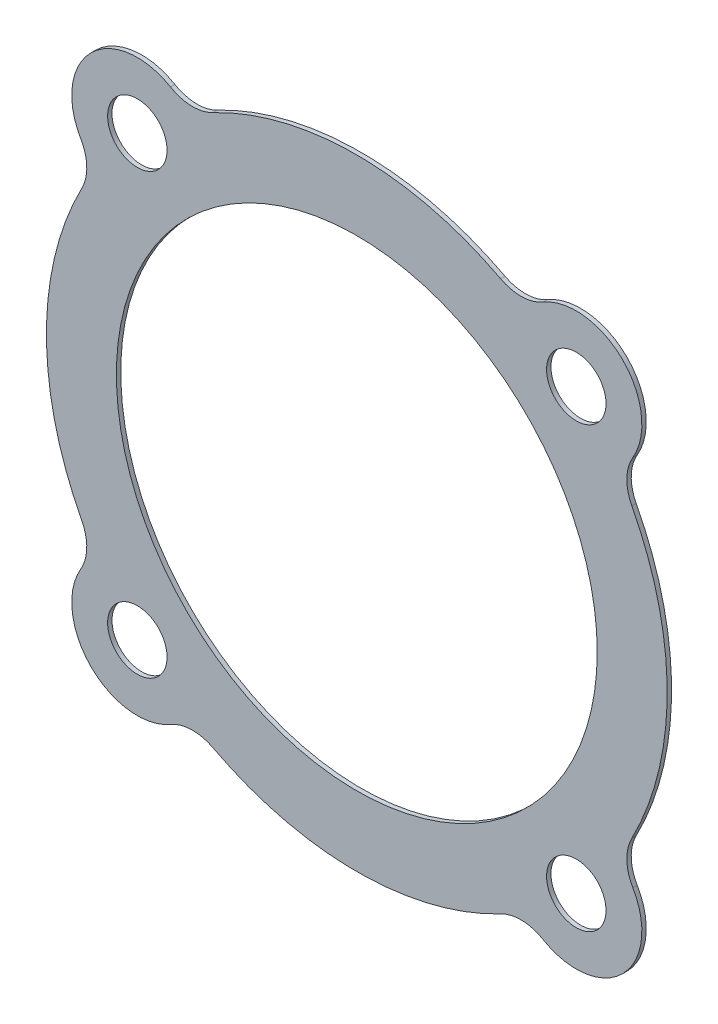
ISO-10303-21;
HEADER;
FILE_DESCRIPTION(('STEP AP214'),'2;1');
FILE_NAME('part.step','',(''),(''),'','','');
FILE_SCHEMA(('AUTOMOTIVE_DESIGN { 1 0 10303 214 1 1 1 1 }'));
ENDSEC;
DATA;
#1=APPLICATION_CONTEXT('core data for automotive mechanical design processes');
#2=APPLICATION_PROTOCOL_DEFINITION('international standard','automotive_design',2000,#1);
#3=PRODUCT_CONTEXT('',#1,'mechanical');
#4=PRODUCT('Part','Part','',(#3));
#5=PRODUCT_RELATED_PRODUCT_CATEGORY('part','',(#4));
#6=PRODUCT_DEFINITION_FORMATION('','',#4);
#7=PRODUCT_DEFINITION_CONTEXT('part definition',#1,'design');
#8=PRODUCT_DEFINITION('design','',#6,#7);
#9=PRODUCT_DEFINITION_SHAPE('','',#8);
#10=(LENGTH_UNIT() NAMED_UNIT(*) SI_UNIT(.MILLI.,.METRE.));
#11=(NAMED_UNIT(*) PLANE_ANGLE_UNIT() SI_UNIT($,.RADIAN.));
#12=(NAMED_UNIT(*) SI_UNIT($,.STERADIAN.) SOLID_ANGLE_UNIT());
#13=UNCERTAINTY_MEASURE_WITH_UNIT(LENGTH_MEASURE(1.E-05),#10,'distance_accuracy_value','');
#14=(GEOMETRIC_REPRESENTATION_CONTEXT(3) GLOBAL_UNCERTAINTY_ASSIGNED_CONTEXT((#13)) GLOBAL_UNIT_ASSIGNED_CONTEXT((#10,
#11,#12)) REPRESENTATION_CONTEXT('',''));
#15=CARTESIAN_POINT('',(0.,0.,0.));
#16=DIRECTION('',(0.,0.,1.));
#17=DIRECTION('',(1.,0.,0.));
#18=AXIS2_PLACEMENT_3D('',#15,#16,#17);
#19=CARTESIAN_POINT('',(22.786336656438,11.9236180763001,0.635));
#20=DIRECTION('',(0.,0.,1.));
#21=DIRECTION('',(1.,0.,0.));
#22=AXIS2_PLACEMENT_3D('',#19,#20,#21);
#23=PLANE('',#22);
#24=CARTESIAN_POINT('',(-31.8799092297954,-31.8799092297955,0.635));
#25=DIRECTION('',(0.,0.,1.));
#26=DIRECTION('',(1.,0.,0.));
#27=AXIS2_PLACEMENT_3D('',#24,#25,#26);
#28=CIRCLE('',#27,4.318);
#29=CARTESIAN_POINT('',(-27.5619092297954,-31.8799092297955,0.635));
#30=VERTEX_POINT('',#29);
#31=EDGE_CURVE('E400',#30,#30,#28,.T.);
#32=ORIENTED_EDGE('',*,*,#31,.F.);
#33=EDGE_LOOP('',(#32));
#34=FACE_BOUND('',#33,.T.);
#35=CARTESIAN_POINT('',(31.8799092297954,31.8799092297955,0.635));
#36=DIRECTION('',(0.,0.,1.));
#37=DIRECTION('',(1.,0.,0.));
#38=AXIS2_PLACEMENT_3D('',#35,#36,#37);
#39=CIRCLE('',#38,4.318);
#40=CARTESIAN_POINT('',(36.1979092297954,31.8799092297955,0.635));
#41=VERTEX_POINT('',#40);
#42=EDGE_CURVE('E416',#41,#41,#39,.T.);
#43=ORIENTED_EDGE('',*,*,#42,.F.);
#44=EDGE_LOOP('',(#43));
#45=FACE_BOUND('',#44,.T.);
#46=CARTESIAN_POINT('',(0.,0.,0.635));
#47=DIRECTION('',(0.,0.,1.));
#48=DIRECTION('',(1.,0.,0.));
#49=AXIS2_PLACEMENT_3D('',#46,#47,#48);
#50=CIRCLE('',#49,45.085);
#51=CARTESIAN_POINT('',(39.9464173483234,-20.9031329238841,0.635));
#52=VERTEX_POINT('',#51);
#53=CARTESIAN_POINT('',(39.9464173483234,20.9031329238841,0.635));
#54=VERTEX_POINT('',#53);
#55=EDGE_CURVE('E236',#52,#54,#50,.T.);
#56=ORIENTED_EDGE('',*,*,#55,.T.);
#57=CARTESIAN_POINT('',(45.572673312876,23.8472361526002,0.635));
#58=DIRECTION('',(0.,0.,-1.));
#59=DIRECTION('',(-1.,0.,0.));
#60=AXIS2_PLACEMENT_3D('',#57,#58,#59);
#61=CIRCLE('',#60,6.35);
#62=CARTESIAN_POINT('',(40.0955676796438,27.0603053834783,0.635));
#63=VERTEX_POINT('',#62);
#64=EDGE_CURVE('E124',#54,#63,#61,.T.);
#65=ORIENTED_EDGE('',*,*,#64,.T.);
#66=CARTESIAN_POINT('',(31.8799092297954,31.8799092297955,0.635));
#67=DIRECTION('',(0.,0.,1.));
#68=DIRECTION('',(1.,0.,0.));
#69=AXIS2_PLACEMENT_3D('',#66,#67,#68);
#70=CIRCLE('',#69,9.525);
#71=CARTESIAN_POINT('',(27.0603053834782,40.0955676796439,0.635));
#72=VERTEX_POINT('',#71);
#73=EDGE_CURVE('E289',#63,#72,#70,.T.);
#74=ORIENTED_EDGE('',*,*,#73,.T.);
#75=CARTESIAN_POINT('',(23.8472361526,45.5726733128761,0.635));
#76=DIRECTION('',(0.,0.,-1.));
#77=DIRECTION('',(1.,0.,0.));
#78=AXIS2_PLACEMENT_3D('',#75,#76,#77);
#79=CIRCLE('',#78,6.35);
#80=CARTESIAN_POINT('',(20.903132923884,39.9464173483235,0.635));
#81=VERTEX_POINT('',#80);
#82=EDGE_CURVE('E309',#72,#81,#79,.T.);
#83=ORIENTED_EDGE('',*,*,#82,.T.);
#84=CARTESIAN_POINT('',(0.,0.,0.635));
#85=DIRECTION('',(0.,0.,1.));
#86=DIRECTION('',(1.,0.,0.));
#87=AXIS2_PLACEMENT_3D('',#84,#85,#86);
#88=CIRCLE('',#87,45.085);
#89=CARTESIAN_POINT('',(-20.9031329238839,39.9464173483235,0.635));
#90=VERTEX_POINT('',#89);
#91=EDGE_CURVE('E305',#81,#90,#88,.T.);
#92=ORIENTED_EDGE('',*,*,#91,.T.);
#93=CARTESIAN_POINT('',(-23.8472361526,45.5726733128761,0.635));
#94=DIRECTION('',(0.,0.,-1.));
#95=DIRECTION('',(-1.,0.,0.));
#96=AXIS2_PLACEMENT_3D('',#93,#94,#95);
#97=CIRCLE('',#96,6.35);
#98=CARTESIAN_POINT('',(-27.0603053834782,40.0955676796439,0.635));
#99=VERTEX_POINT('',#98);
#100=EDGE_CURVE('E308',#90,#99,#97,.T.);
#101=ORIENTED_EDGE('',*,*,#100,.T.);
#102=CARTESIAN_POINT('',(-31.8799092297954,31.8799092297955,0.635));
#103=DIRECTION('',(0.,0.,1.));
#104=DIRECTION('',(-1.,0.,0.));
#105=AXIS2_PLACEMENT_3D('',#102,#103,#104);
#106=CIRCLE('',#105,9.525);
#107=CARTESIAN_POINT('',(-40.0955676796438,27.0603053834783,0.635));
#108=VERTEX_POINT('',#107);
#109=EDGE_CURVE('E313',#99,#108,#106,.T.);
#110=ORIENTED_EDGE('',*,*,#109,.T.);
#111=CARTESIAN_POINT('',(-45.572673312876,23.8472361526002,0.635));
#112=DIRECTION('',(0.,0.,-1.));
#113=DIRECTION('',(1.,0.,0.));
#114=AXIS2_PLACEMENT_3D('',#111,#112,#113);
#115=CIRCLE('',#114,6.35);
#116=CARTESIAN_POINT('',(-39.9464173483234,20.9031329238841,0.635));
#117=VERTEX_POINT('',#116);
#118=EDGE_CURVE('E320',#108,#117,#115,.T.);
#119=ORIENTED_EDGE('',*,*,#118,.T.);
#120=CARTESIAN_POINT('',(0.,0.,0.635));
#121=DIRECTION('',(0.,0.,1.));
#122=DIRECTION('',(1.,0.,0.));
#123=AXIS2_PLACEMENT_3D('',#120,#121,#122);
#124=CIRCLE('',#123,45.085);
#125=CARTESIAN_POINT('',(-39.9464173483234,-20.9031329238841,0.635));
#126=VERTEX_POINT('',#125);
#127=EDGE_CURVE('E323',#117,#126,#124,.T.);
#128=ORIENTED_EDGE('',*,*,#127,.T.);
#129=CARTESIAN_POINT('',(-45.572673312876,-23.8472361526002,0.635));
#130=DIRECTION('',(0.,0.,-1.));
#131=DIRECTION('',(-1.,0.,0.));
#132=AXIS2_PLACEMENT_3D('',#129,#130,#131);
#133=CIRCLE('',#132,6.35);
#134=CARTESIAN_POINT('',(-40.0955676796438,-27.0603053834783,0.635));
#135=VERTEX_POINT('',#134);
#136=EDGE_CURVE('E326',#126,#135,#133,.T.);
#137=ORIENTED_EDGE('',*,*,#136,.T.);
#138=CARTESIAN_POINT('',(-31.8799092297954,-31.8799092297955,0.635));
#139=DIRECTION('',(0.,0.,1.));
#140=DIRECTION('',(1.,0.,0.));
#141=AXIS2_PLACEMENT_3D('',#138,#139,#140);
#142=CIRCLE('',#141,9.525);
#143=CARTESIAN_POINT('',(-27.0603053834782,-40.0955676796439,0.635));
#144=VERTEX_POINT('',#143);
#145=EDGE_CURVE('E329',#135,#144,#142,.T.);
#146=ORIENTED_EDGE('',*,*,#145,.T.);
#147=CARTESIAN_POINT('',(-23.8472361526,-45.5726733128761,0.635));
#148=DIRECTION('',(0.,0.,-1.));
#149=DIRECTION('',(1.,0.,0.));
#150=AXIS2_PLACEMENT_3D('',#147,#148,#149);
#151=CIRCLE('',#150,6.35);
#152=CARTESIAN_POINT('',(-20.903132923884,-39.9464173483235,0.635));
#153=VERTEX_POINT('',#152);
#154=EDGE_CURVE('E332',#144,#153,#151,.T.);
#155=ORIENTED_EDGE('',*,*,#154,.T.);
#156=CARTESIAN_POINT('',(0.,0.,0.635));
#157=DIRECTION('',(0.,0.,1.));
#158=DIRECTION('',(1.,0.,0.));
#159=AXIS2_PLACEMENT_3D('',#156,#157,#158);
#160=CIRCLE('',#159,45.085);
#161=CARTESIAN_POINT('',(20.9031329238839,-39.9464173483235,0.635));
#162=VERTEX_POINT('',#161);
#163=EDGE_CURVE('E167',#153,#162,#160,.T.);
#164=ORIENTED_EDGE('',*,*,#163,.T.);
#165=CARTESIAN_POINT('',(23.8472361526,-45.5726733128761,0.635));
#166=DIRECTION('',(0.,0.,-1.));
#167=DIRECTION('',(-1.,0.,0.));
#168=AXIS2_PLACEMENT_3D('',#165,#166,#167);
#169=CIRCLE('',#168,6.35);
#170=CARTESIAN_POINT('',(27.0603053834782,-40.0955676796439,0.635));
#171=VERTEX_POINT('',#170);
#172=EDGE_CURVE('E161',#162,#171,#169,.T.);
#173=ORIENTED_EDGE('',*,*,#172,.T.);
#174=CARTESIAN_POINT('',(31.8799092297954,-31.8799092297955,0.635));
#175=DIRECTION('',(0.,0.,1.));
#176=DIRECTION('',(-1.,0.,0.));
#177=AXIS2_PLACEMENT_3D('',#174,#175,#176);
#178=CIRCLE('',#177,9.525);
#179=CARTESIAN_POINT('',(40.0955676796438,-27.0603053834783,0.635));
#180=VERTEX_POINT('',#179);
#181=EDGE_CURVE('E165',#171,#180,#178,.T.);
#182=ORIENTED_EDGE('',*,*,#181,.T.);
#183=CARTESIAN_POINT('',(45.572673312876,-23.8472361526002,0.635));
#184=DIRECTION('',(0.,0.,-1.));
#185=DIRECTION('',(1.,0.,0.));
#186=AXIS2_PLACEMENT_3D('',#183,#184,#185);
#187=CIRCLE('',#186,6.35);
#188=EDGE_CURVE('E57',#180,#52,#187,.T.);
#189=ORIENTED_EDGE('',*,*,#188,.T.);
#190=EDGE_LOOP('',(#56,#65,#74,#83,#92,#101,#110,#119,#128,#137,#146,#155,#164,#173,#182,#189));
#191=FACE_BOUND('',#190,.T.);
#192=CARTESIAN_POINT('',(0.,0.,0.635));
#193=DIRECTION('',(0.,0.,1.));
#194=DIRECTION('',(1.,0.,0.));
#195=AXIS2_PLACEMENT_3D('',#192,#193,#194);
#196=CIRCLE('',#195,34.925);
#197=CARTESIAN_POINT('',(34.925,0.,0.635));
#198=VERTEX_POINT('',#197);
#199=EDGE_CURVE('E194',#198,#198,#196,.T.);
#200=ORIENTED_EDGE('',*,*,#199,.F.);
#201=EDGE_LOOP('',(#200));
#202=FACE_BOUND('',#201,.T.);
#203=CARTESIAN_POINT('',(31.8799092297954,-31.8799092297955,0.635));
#204=DIRECTION('',(0.,0.,1.));
#205=DIRECTION('',(-1.,0.,0.));
#206=AXIS2_PLACEMENT_3D('',#203,#204,#205);
#207=CIRCLE('',#206,4.318);
#208=CARTESIAN_POINT('',(27.5619092297954,-31.8799092297955,0.635));
#209=VERTEX_POINT('',#208);
#210=EDGE_CURVE('E408',#209,#209,#207,.T.);
#211=ORIENTED_EDGE('',*,*,#210,.F.);
#212=EDGE_LOOP('',(#211));
#213=FACE_BOUND('',#212,.T.);
#214=CARTESIAN_POINT('',(-31.8799092297954,31.8799092297955,0.635));
#215=DIRECTION('',(0.,0.,1.));
#216=DIRECTION('',(-1.,0.,0.));
#217=AXIS2_PLACEMENT_3D('',#214,#215,#216);
#218=CIRCLE('',#217,4.318);
#219=CARTESIAN_POINT('',(-36.1979092297954,31.8799092297955,0.635));
#220=VERTEX_POINT('',#219);
#221=EDGE_CURVE('E389',#220,#220,#218,.T.);
#222=ORIENTED_EDGE('',*,*,#221,.F.);
#223=EDGE_LOOP('',(#222));
#224=FACE_BOUND('',#223,.T.);
#225=ADVANCED_FACE('F39',(#34,#45,#191,#202,#213,#224),#23,.T.);
#226=CARTESIAN_POINT('',(22.786336656438,11.9236180763001,0.));
#227=DIRECTION('',(0.,0.,1.));
#228=DIRECTION('',(1.,0.,0.));
#229=AXIS2_PLACEMENT_3D('',#226,#227,#228);
#230=PLANE('',#229);
#231=CARTESIAN_POINT('',(0.,0.,0.));
#232=DIRECTION('',(0.,0.,1.));
#233=DIRECTION('',(1.,0.,0.));
#234=AXIS2_PLACEMENT_3D('',#231,#232,#233);
#235=CIRCLE('',#234,45.085);
#236=CARTESIAN_POINT('',(39.9464173483234,-20.9031329238841,0.));
#237=VERTEX_POINT('',#236);
#238=CARTESIAN_POINT('',(39.9464173483234,20.9031329238841,0.));
#239=VERTEX_POINT('',#238);
#240=EDGE_CURVE('E189',#237,#239,#235,.T.);
#241=ORIENTED_EDGE('',*,*,#240,.F.);
#242=CARTESIAN_POINT('',(45.572673312876,-23.8472361526002,0.));
#243=DIRECTION('',(0.,0.,-1.));
#244=DIRECTION('',(1.,0.,0.));
#245=AXIS2_PLACEMENT_3D('',#242,#243,#244);
#246=CIRCLE('',#245,6.35);
#247=CARTESIAN_POINT('',(40.0955676796438,-27.0603053834783,0.));
#248=VERTEX_POINT('',#247);
#249=EDGE_CURVE('E116',#248,#237,#246,.T.);
#250=ORIENTED_EDGE('',*,*,#249,.F.);
#251=CARTESIAN_POINT('',(31.8799092297954,-31.8799092297955,0.));
#252=DIRECTION('',(0.,0.,1.));
#253=DIRECTION('',(-1.,0.,0.));
#254=AXIS2_PLACEMENT_3D('',#251,#252,#253);
#255=CIRCLE('',#254,9.525);
#256=CARTESIAN_POINT('',(27.0603053834782,-40.0955676796439,0.));
#257=VERTEX_POINT('',#256);
#258=EDGE_CURVE('E110',#257,#248,#255,.T.);
#259=ORIENTED_EDGE('',*,*,#258,.F.);
#260=CARTESIAN_POINT('',(23.8472361526,-45.5726733128761,0.));
#261=DIRECTION('',(0.,0.,-1.));
#262=DIRECTION('',(-1.,0.,0.));
#263=AXIS2_PLACEMENT_3D('',#260,#261,#262);
#264=CIRCLE('',#263,6.35);
#265=CARTESIAN_POINT('',(20.9031329238839,-39.9464173483235,0.));
#266=VERTEX_POINT('',#265);
#267=EDGE_CURVE('E176',#266,#257,#264,.T.);
#268=ORIENTED_EDGE('',*,*,#267,.F.);
#269=CARTESIAN_POINT('',(0.,0.,0.));
#270=DIRECTION('',(0.,0.,1.));
#271=DIRECTION('',(1.,0.,0.));
#272=AXIS2_PLACEMENT_3D('',#269,#270,#271);
#273=CIRCLE('',#272,45.085);
#274=CARTESIAN_POINT('',(-20.903132923884,-39.9464173483235,0.));
#275=VERTEX_POINT('',#274);
#276=EDGE_CURVE('E227',#275,#266,#273,.T.);
#277=ORIENTED_EDGE('',*,*,#276,.F.);
#278=CARTESIAN_POINT('',(-23.8472361526,-45.5726733128761,0.));
#279=DIRECTION('',(0.,0.,-1.));
#280=DIRECTION('',(1.,0.,0.));
#281=AXIS2_PLACEMENT_3D('',#278,#279,#280);
#282=CIRCLE('',#281,6.35);
#283=CARTESIAN_POINT('',(-27.0603053834782,-40.0955676796439,0.));
#284=VERTEX_POINT('',#283);
#285=EDGE_CURVE('E224',#284,#275,#282,.T.);
#286=ORIENTED_EDGE('',*,*,#285,.F.);
#287=CARTESIAN_POINT('',(-31.8799092297954,-31.8799092297955,0.));
#288=DIRECTION('',(0.,0.,1.));
#289=DIRECTION('',(1.,0.,0.));
#290=AXIS2_PLACEMENT_3D('',#287,#288,#289);
#291=CIRCLE('',#290,9.525);
#292=CARTESIAN_POINT('',(-40.0955676796438,-27.0603053834783,0.));
#293=VERTEX_POINT('',#292);
#294=EDGE_CURVE('E221',#293,#284,#291,.T.);
#295=ORIENTED_EDGE('',*,*,#294,.F.);
#296=CARTESIAN_POINT('',(-45.572673312876,-23.8472361526002,0.));
#297=DIRECTION('',(0.,0.,-1.));
#298=DIRECTION('',(-1.,0.,0.));
#299=AXIS2_PLACEMENT_3D('',#296,#297,#298);
#300=CIRCLE('',#299,6.35);
#301=CARTESIAN_POINT('',(-39.9464173483234,-20.9031329238841,0.));
#302=VERTEX_POINT('',#301);
#303=EDGE_CURVE('E218',#302,#293,#300,.T.);
#304=ORIENTED_EDGE('',*,*,#303,.F.);
#305=CARTESIAN_POINT('',(0.,0.,0.));
#306=DIRECTION('',(0.,0.,1.));
#307=DIRECTION('',(1.,0.,0.));
#308=AXIS2_PLACEMENT_3D('',#305,#306,#307);
#309=CIRCLE('',#308,45.085);
#310=CARTESIAN_POINT('',(-39.9464173483234,20.9031329238841,0.));
#311=VERTEX_POINT('',#310);
#312=EDGE_CURVE('E215',#311,#302,#309,.T.);
#313=ORIENTED_EDGE('',*,*,#312,.F.);
#314=CARTESIAN_POINT('',(-45.572673312876,23.8472361526002,0.));
#315=DIRECTION('',(0.,0.,-1.));
#316=DIRECTION('',(1.,0.,0.));
#317=AXIS2_PLACEMENT_3D('',#314,#315,#316);
#318=CIRCLE('',#317,6.35);
#319=CARTESIAN_POINT('',(-40.0955676796438,27.0603053834783,0.));
#320=VERTEX_POINT('',#319);
#321=EDGE_CURVE('E212',#320,#311,#318,.T.);
#322=ORIENTED_EDGE('',*,*,#321,.F.);
#323=CARTESIAN_POINT('',(-31.8799092297954,31.8799092297955,0.));
#324=DIRECTION('',(0.,0.,1.));
#325=DIRECTION('',(-1.,0.,0.));
#326=AXIS2_PLACEMENT_3D('',#323,#324,#325);
#327=CIRCLE('',#326,9.525);
#328=CARTESIAN_POINT('',(-27.0603053834782,40.0955676796439,0.));
#329=VERTEX_POINT('',#328);
#330=EDGE_CURVE('E209',#329,#320,#327,.T.);
#331=ORIENTED_EDGE('',*,*,#330,.F.);
#332=CARTESIAN_POINT('',(-23.8472361526,45.5726733128761,0.));
#333=DIRECTION('',(0.,0.,-1.));
#334=DIRECTION('',(-1.,0.,0.));
#335=AXIS2_PLACEMENT_3D('',#332,#333,#334);
#336=CIRCLE('',#335,6.35);
#337=CARTESIAN_POINT('',(-20.9031329238839,39.9464173483235,0.));
#338=VERTEX_POINT('',#337);
#339=EDGE_CURVE('E206',#338,#329,#336,.T.);
#340=ORIENTED_EDGE('',*,*,#339,.F.);
#341=CARTESIAN_POINT('',(0.,0.,0.));
#342=DIRECTION('',(0.,0.,1.));
#343=DIRECTION('',(1.,0.,0.));
#344=AXIS2_PLACEMENT_3D('',#341,#342,#343);
#345=CIRCLE('',#344,45.085);
#346=CARTESIAN_POINT('',(20.903132923884,39.9464173483235,0.));
#347=VERTEX_POINT('',#346);
#348=EDGE_CURVE('E203',#347,#338,#345,.T.);
#349=ORIENTED_EDGE('',*,*,#348,.F.);
#350=CARTESIAN_POINT('',(23.8472361526,45.5726733128761,0.));
#351=DIRECTION('',(0.,0.,-1.));
#352=DIRECTION('',(1.,0.,0.));
#353=AXIS2_PLACEMENT_3D('',#350,#351,#352);
#354=CIRCLE('',#353,6.35);
#355=CARTESIAN_POINT('',(27.0603053834782,40.0955676796439,0.));
#356=VERTEX_POINT('',#355);
#357=EDGE_CURVE('E200',#356,#347,#354,.T.);
#358=ORIENTED_EDGE('',*,*,#357,.F.);
#359=CARTESIAN_POINT('',(31.8799092297954,31.8799092297955,0.));
#360=DIRECTION('',(0.,0.,1.));
#361=DIRECTION('',(1.,0.,0.));
#362=AXIS2_PLACEMENT_3D('',#359,#360,#361);
#363=CIRCLE('',#362,9.525);
#364=CARTESIAN_POINT('',(40.0955676796438,27.0603053834783,0.));
#365=VERTEX_POINT('',#364);
#366=EDGE_CURVE('E197',#365,#356,#363,.T.);
#367=ORIENTED_EDGE('',*,*,#366,.F.);
#368=CARTESIAN_POINT('',(45.572673312876,23.8472361526002,0.));
#369=DIRECTION('',(0.,0.,-1.));
#370=DIRECTION('',(-1.,0.,0.));
#371=AXIS2_PLACEMENT_3D('',#368,#369,#370);
#372=CIRCLE('',#371,6.35);
#373=EDGE_CURVE('E193',#239,#365,#372,.T.);
#374=ORIENTED_EDGE('',*,*,#373,.F.);
#375=EDGE_LOOP('',(#241,#250,#259,#268,#277,#286,#295,#304,#313,#322,#331,#340,#349,#358,#367,#374));
#376=FACE_BOUND('',#375,.T.);
#377=CARTESIAN_POINT('',(0.,0.,0.));
#378=DIRECTION('',(0.,0.,1.));
#379=DIRECTION('',(1.,0.,0.));
#380=AXIS2_PLACEMENT_3D('',#377,#378,#379);
#381=CIRCLE('',#380,34.925);
#382=CARTESIAN_POINT('',(34.925,0.,0.));
#383=VERTEX_POINT('',#382);
#384=EDGE_CURVE('E420',#383,#383,#381,.T.);
#385=ORIENTED_EDGE('',*,*,#384,.T.);
#386=EDGE_LOOP('',(#385));
#387=FACE_BOUND('',#386,.T.);
#388=CARTESIAN_POINT('',(31.8799092297954,31.8799092297955,0.));
#389=DIRECTION('',(0.,0.,1.));
#390=DIRECTION('',(1.,0.,0.));
#391=AXIS2_PLACEMENT_3D('',#388,#389,#390);
#392=CIRCLE('',#391,4.318);
#393=CARTESIAN_POINT('',(36.1979092297954,31.8799092297955,0.));
#394=VERTEX_POINT('',#393);
#395=EDGE_CURVE('E412',#394,#394,#392,.T.);
#396=ORIENTED_EDGE('',*,*,#395,.T.);
#397=EDGE_LOOP('',(#396));
#398=FACE_BOUND('',#397,.T.);
#399=CARTESIAN_POINT('',(31.8799092297954,-31.8799092297955,0.));
#400=DIRECTION('',(0.,0.,1.));
#401=DIRECTION('',(-1.,0.,0.));
#402=AXIS2_PLACEMENT_3D('',#399,#400,#401);
#403=CIRCLE('',#402,4.318);
#404=CARTESIAN_POINT('',(27.5619092297954,-31.8799092297955,0.));
#405=VERTEX_POINT('',#404);
#406=EDGE_CURVE('E404',#405,#405,#403,.T.);
#407=ORIENTED_EDGE('',*,*,#406,.T.);
#408=EDGE_LOOP('',(#407));
#409=FACE_BOUND('',#408,.T.);
#410=CARTESIAN_POINT('',(-31.8799092297954,-31.8799092297955,0.));
#411=DIRECTION('',(0.,0.,1.));
#412=DIRECTION('',(1.,0.,0.));
#413=AXIS2_PLACEMENT_3D('',#410,#411,#412);
#414=CIRCLE('',#413,4.318);
#415=CARTESIAN_POINT('',(-27.5619092297954,-31.8799092297955,0.));
#416=VERTEX_POINT('',#415);
#417=EDGE_CURVE('E397',#416,#416,#414,.T.);
#418=ORIENTED_EDGE('',*,*,#417,.T.);
#419=EDGE_LOOP('',(#418));
#420=FACE_BOUND('',#419,.T.);
#421=CARTESIAN_POINT('',(-31.8799092297954,31.8799092297955,0.));
#422=DIRECTION('',(0.,0.,1.));
#423=DIRECTION('',(-1.,0.,0.));
#424=AXIS2_PLACEMENT_3D('',#421,#422,#423);
#425=CIRCLE('',#424,4.318);
#426=CARTESIAN_POINT('',(-36.1979092297954,31.8799092297955,0.));
#427=VERTEX_POINT('',#426);
#428=EDGE_CURVE('E392',#427,#427,#425,.T.);
#429=ORIENTED_EDGE('',*,*,#428,.T.);
#430=EDGE_LOOP('',(#429));
#431=FACE_BOUND('',#430,.T.);
#432=ADVANCED_FACE('F293',(#376,#387,#398,#409,#420,#431),#230,.F.);
#433=CARTESIAN_POINT('',(0.,0.,0.635));
#434=DIRECTION('',(0.,0.,-1.));
#435=DIRECTION('',(-1.,0.,0.));
#436=AXIS2_PLACEMENT_3D('',#433,#434,#435);
#437=CYLINDRICAL_SURFACE('',#436,45.085);
#438=ORIENTED_EDGE('',*,*,#240,.T.);
#439=DIRECTION('',(0.,0.,-1.));
#440=VECTOR('',#439,1.);
#441=CARTESIAN_POINT('',(39.9464173483234,20.9031329238841,0.635));
#442=LINE('',#441,#440);
#443=EDGE_CURVE('E11',#54,#239,#442,.T.);
#444=ORIENTED_EDGE('',*,*,#443,.F.);
#445=ORIENTED_EDGE('',*,*,#55,.F.);
#446=DIRECTION('',(0.,0.,-1.));
#447=VECTOR('',#446,1.);
#448=CARTESIAN_POINT('',(39.9464173483234,-20.9031329238841,0.635));
#449=LINE('',#448,#447);
#450=EDGE_CURVE('E185',#52,#237,#449,.T.);
#451=ORIENTED_EDGE('',*,*,#450,.T.);
#452=EDGE_LOOP('',(#438,#444,#445,#451));
#453=FACE_BOUND('',#452,.T.);
#454=ADVANCED_FACE('F41',(#453),#437,.T.);
#455=CARTESIAN_POINT('',(45.572673312876,23.8472361526002,0.635));
#456=DIRECTION('',(0.,0.,-1.));
#457=DIRECTION('',(-1.,0.,0.));
#458=AXIS2_PLACEMENT_3D('',#455,#456,#457);
#459=CYLINDRICAL_SURFACE('',#458,6.35);
#460=ORIENTED_EDGE('',*,*,#373,.T.);
#461=DIRECTION('',(0.,0.,-1.));
#462=VECTOR('',#461,1.);
#463=CARTESIAN_POINT('',(40.0955676796438,27.0603053834783,0.635));
#464=LINE('',#463,#462);
#465=EDGE_CURVE('E49',#63,#365,#464,.T.);
#466=ORIENTED_EDGE('',*,*,#465,.F.);
#467=ORIENTED_EDGE('',*,*,#64,.F.);
#468=ORIENTED_EDGE('',*,*,#443,.T.);
#469=EDGE_LOOP('',(#460,#466,#467,#468));
#470=FACE_BOUND('',#469,.T.);
#471=ADVANCED_FACE('F585',(#470),#459,.F.);
#472=CARTESIAN_POINT('',(31.8799092297954,31.8799092297955,0.635));
#473=DIRECTION('',(0.,0.,-1.));
#474=DIRECTION('',(-1.,0.,0.));
#475=AXIS2_PLACEMENT_3D('',#472,#473,#474);
#476=CYLINDRICAL_SURFACE('',#475,9.525);
#477=ORIENTED_EDGE('',*,*,#366,.T.);
#478=DIRECTION('',(0.,0.,-1.));
#479=VECTOR('',#478,1.);
#480=CARTESIAN_POINT('',(27.0603053834782,40.0955676796439,0.635));
#481=LINE('',#480,#479);
#482=EDGE_CURVE('E279',#72,#356,#481,.T.);
#483=ORIENTED_EDGE('',*,*,#482,.F.);
#484=ORIENTED_EDGE('',*,*,#73,.F.);
#485=ORIENTED_EDGE('',*,*,#465,.T.);
#486=EDGE_LOOP('',(#477,#483,#484,#485));
#487=FACE_BOUND('',#486,.T.);
#488=ADVANCED_FACE('F287',(#487),#476,.T.);
#489=CARTESIAN_POINT('',(23.8472361526,45.5726733128761,0.635));
#490=DIRECTION('',(0.,0.,-1.));
#491=DIRECTION('',(-1.,0.,0.));
#492=AXIS2_PLACEMENT_3D('',#489,#490,#491);
#493=CYLINDRICAL_SURFACE('',#492,6.35);
#494=ORIENTED_EDGE('',*,*,#357,.T.);
#495=DIRECTION('',(0.,0.,-1.));
#496=VECTOR('',#495,1.);
#497=CARTESIAN_POINT('',(20.903132923884,39.9464173483235,0.635));
#498=LINE('',#497,#496);
#499=EDGE_CURVE('E275',#81,#347,#498,.T.);
#500=ORIENTED_EDGE('',*,*,#499,.F.);
#501=ORIENTED_EDGE('',*,*,#82,.F.);
#502=ORIENTED_EDGE('',*,*,#482,.T.);
#503=EDGE_LOOP('',(#494,#500,#501,#502));
#504=FACE_BOUND('',#503,.T.);
#505=ADVANCED_FACE('F299',(#504),#493,.F.);
#506=CARTESIAN_POINT('',(0.,0.,0.635));
#507=DIRECTION('',(0.,0.,-1.));
#508=DIRECTION('',(-1.,0.,0.));
#509=AXIS2_PLACEMENT_3D('',#506,#507,#508);
#510=CYLINDRICAL_SURFACE('',#509,45.085);
#511=ORIENTED_EDGE('',*,*,#348,.T.);
#512=DIRECTION('',(0.,0.,-1.));
#513=VECTOR('',#512,1.);
#514=CARTESIAN_POINT('',(-20.9031329238839,39.9464173483235,0.635));
#515=LINE('',#514,#513);
#516=EDGE_CURVE('E271',#90,#338,#515,.T.);
#517=ORIENTED_EDGE('',*,*,#516,.F.);
#518=ORIENTED_EDGE('',*,*,#91,.F.);
#519=ORIENTED_EDGE('',*,*,#499,.T.);
#520=EDGE_LOOP('',(#511,#517,#518,#519));
#521=FACE_BOUND('',#520,.T.);
#522=ADVANCED_FACE('F303',(#521),#510,.T.);
#523=CARTESIAN_POINT('',(-23.8472361526,45.5726733128761,0.635));
#524=DIRECTION('',(0.,0.,-1.));
#525=DIRECTION('',(-1.,0.,0.));
#526=AXIS2_PLACEMENT_3D('',#523,#524,#525);
#527=CYLINDRICAL_SURFACE('',#526,6.35);
#528=ORIENTED_EDGE('',*,*,#339,.T.);
#529=DIRECTION('',(0.,0.,-1.));
#530=VECTOR('',#529,1.);
#531=CARTESIAN_POINT('',(-27.0603053834782,40.0955676796439,0.635));
#532=LINE('',#531,#530);
#533=EDGE_CURVE('E267',#99,#329,#532,.T.);
#534=ORIENTED_EDGE('',*,*,#533,.F.);
#535=ORIENTED_EDGE('',*,*,#100,.F.);
#536=ORIENTED_EDGE('',*,*,#516,.T.);
#537=EDGE_LOOP('',(#528,#534,#535,#536));
#538=FACE_BOUND('',#537,.T.);
#539=ADVANCED_FACE('F550',(#538),#527,.F.);
#540=CARTESIAN_POINT('',(-31.8799092297954,31.8799092297955,0.635));
#541=DIRECTION('',(0.,0.,-1.));
#542=DIRECTION('',(-1.,0.,0.));
#543=AXIS2_PLACEMENT_3D('',#540,#541,#542);
#544=CYLINDRICAL_SURFACE('',#543,9.525);
#545=ORIENTED_EDGE('',*,*,#330,.T.);
#546=DIRECTION('',(0.,0.,-1.));
#547=VECTOR('',#546,1.);
#548=CARTESIAN_POINT('',(-40.0955676796438,27.0603053834783,0.635));
#549=LINE('',#548,#547);
#550=EDGE_CURVE('E263',#108,#320,#549,.T.);
#551=ORIENTED_EDGE('',*,*,#550,.F.);
#552=ORIENTED_EDGE('',*,*,#109,.F.);
#553=ORIENTED_EDGE('',*,*,#533,.T.);
#554=EDGE_LOOP('',(#545,#551,#552,#553));
#555=FACE_BOUND('',#554,.T.);
#556=ADVANCED_FACE('F540',(#555),#544,.T.);
#557=CARTESIAN_POINT('',(-45.572673312876,23.8472361526002,0.635));
#558=DIRECTION('',(0.,0.,-1.));
#559=DIRECTION('',(-1.,0.,0.));
#560=AXIS2_PLACEMENT_3D('',#557,#558,#559);
#561=CYLINDRICAL_SURFACE('',#560,6.35);
#562=ORIENTED_EDGE('',*,*,#321,.T.);
#563=DIRECTION('',(0.,0.,-1.));
#564=VECTOR('',#563,1.);
#565=CARTESIAN_POINT('',(-39.9464173483234,20.9031329238841,0.635));
#566=LINE('',#565,#564);
#567=EDGE_CURVE('E259',#117,#311,#566,.T.);
#568=ORIENTED_EDGE('',*,*,#567,.F.);
#569=ORIENTED_EDGE('',*,*,#118,.F.);
#570=ORIENTED_EDGE('',*,*,#550,.T.);
#571=EDGE_LOOP('',(#562,#568,#569,#570));
#572=FACE_BOUND('',#571,.T.);
#573=ADVANCED_FACE('F530',(#572),#561,.F.);
#574=CARTESIAN_POINT('',(0.,0.,0.635));
#575=DIRECTION('',(0.,0.,-1.));
#576=DIRECTION('',(-1.,0.,0.));
#577=AXIS2_PLACEMENT_3D('',#574,#575,#576);
#578=CYLINDRICAL_SURFACE('',#577,45.085);
#579=ORIENTED_EDGE('',*,*,#312,.T.);
#580=DIRECTION('',(0.,0.,-1.));
#581=VECTOR('',#580,1.);
#582=CARTESIAN_POINT('',(-39.9464173483234,-20.9031329238841,0.635));
#583=LINE('',#582,#581);
#584=EDGE_CURVE('E255',#126,#302,#583,.T.);
#585=ORIENTED_EDGE('',*,*,#584,.F.);
#586=ORIENTED_EDGE('',*,*,#127,.F.);
#587=ORIENTED_EDGE('',*,*,#567,.T.);
#588=EDGE_LOOP('',(#579,#585,#586,#587));
#589=FACE_BOUND('',#588,.T.);
#590=ADVANCED_FACE('F520',(#589),#578,.T.);
#591=CARTESIAN_POINT('',(-45.572673312876,-23.8472361526002,0.635));
#592=DIRECTION('',(0.,0.,-1.));
#593=DIRECTION('',(-1.,0.,0.));
#594=AXIS2_PLACEMENT_3D('',#591,#592,#593);
#595=CYLINDRICAL_SURFACE('',#594,6.35);
#596=ORIENTED_EDGE('',*,*,#303,.T.);
#597=DIRECTION('',(0.,0.,-1.));
#598=VECTOR('',#597,1.);
#599=CARTESIAN_POINT('',(-40.0955676796438,-27.0603053834783,0.635));
#600=LINE('',#599,#598);
#601=EDGE_CURVE('E251',#135,#293,#600,.T.);
#602=ORIENTED_EDGE('',*,*,#601,.F.);
#603=ORIENTED_EDGE('',*,*,#136,.F.);
#604=ORIENTED_EDGE('',*,*,#584,.T.);
#605=EDGE_LOOP('',(#596,#602,#603,#604));
#606=FACE_BOUND('',#605,.T.);
#607=ADVANCED_FACE('F510',(#606),#595,.F.);
#608=CARTESIAN_POINT('',(-31.8799092297954,-31.8799092297955,0.635));
#609=DIRECTION('',(0.,0.,-1.));
#610=DIRECTION('',(-1.,0.,0.));
#611=AXIS2_PLACEMENT_3D('',#608,#609,#610);
#612=CYLINDRICAL_SURFACE('',#611,9.525);
#613=ORIENTED_EDGE('',*,*,#294,.T.);
#614=DIRECTION('',(0.,0.,-1.));
#615=VECTOR('',#614,1.);
#616=CARTESIAN_POINT('',(-27.0603053834782,-40.0955676796439,0.635));
#617=LINE('',#616,#615);
#618=EDGE_CURVE('E247',#144,#284,#617,.T.);
#619=ORIENTED_EDGE('',*,*,#618,.F.);
#620=ORIENTED_EDGE('',*,*,#145,.F.);
#621=ORIENTED_EDGE('',*,*,#601,.T.);
#622=EDGE_LOOP('',(#613,#619,#620,#621));
#623=FACE_BOUND('',#622,.T.);
#624=ADVANCED_FACE('F501',(#623),#612,.T.);
#625=CARTESIAN_POINT('',(-23.8472361526,-45.5726733128761,0.635));
#626=DIRECTION('',(0.,0.,-1.));
#627=DIRECTION('',(-1.,0.,0.));
#628=AXIS2_PLACEMENT_3D('',#625,#626,#627);
#629=CYLINDRICAL_SURFACE('',#628,6.35);
#630=ORIENTED_EDGE('',*,*,#285,.T.);
#631=DIRECTION('',(0.,0.,-1.));
#632=VECTOR('',#631,1.);
#633=CARTESIAN_POINT('',(-20.903132923884,-39.9464173483235,0.635));
#634=LINE('',#633,#632);
#635=EDGE_CURVE('E243',#153,#275,#634,.T.);
#636=ORIENTED_EDGE('',*,*,#635,.F.);
#637=ORIENTED_EDGE('',*,*,#154,.F.);
#638=ORIENTED_EDGE('',*,*,#618,.T.);
#639=EDGE_LOOP('',(#630,#636,#637,#638));
#640=FACE_BOUND('',#639,.T.);
#641=ADVANCED_FACE('F340',(#640),#629,.F.);
#642=CARTESIAN_POINT('',(0.,0.,0.635));
#643=DIRECTION('',(0.,0.,-1.));
#644=DIRECTION('',(-1.,0.,0.));
#645=AXIS2_PLACEMENT_3D('',#642,#643,#644);
#646=CYLINDRICAL_SURFACE('',#645,45.085);
#647=ORIENTED_EDGE('',*,*,#276,.T.);
#648=DIRECTION('',(0.,0.,-1.));
#649=VECTOR('',#648,1.);
#650=CARTESIAN_POINT('',(20.9031329238839,-39.9464173483235,0.635));
#651=LINE('',#650,#649);
#652=EDGE_CURVE('E178',#162,#266,#651,.T.);
#653=ORIENTED_EDGE('',*,*,#652,.F.);
#654=ORIENTED_EDGE('',*,*,#163,.F.);
#655=ORIENTED_EDGE('',*,*,#635,.T.);
#656=EDGE_LOOP('',(#647,#653,#654,#655));
#657=FACE_BOUND('',#656,.T.);
#658=ADVANCED_FACE('F344',(#657),#646,.T.);
#659=CARTESIAN_POINT('',(23.8472361526,-45.5726733128761,0.635));
#660=DIRECTION('',(0.,0.,-1.));
#661=DIRECTION('',(-1.,0.,0.));
#662=AXIS2_PLACEMENT_3D('',#659,#660,#661);
#663=CYLINDRICAL_SURFACE('',#662,6.35);
#664=ORIENTED_EDGE('',*,*,#267,.T.);
#665=DIRECTION('',(0.,0.,-1.));
#666=VECTOR('',#665,1.);
#667=CARTESIAN_POINT('',(27.0603053834782,-40.0955676796439,0.635));
#668=LINE('',#667,#666);
#669=EDGE_CURVE('E173',#171,#257,#668,.T.);
#670=ORIENTED_EDGE('',*,*,#669,.F.);
#671=ORIENTED_EDGE('',*,*,#172,.F.);
#672=ORIENTED_EDGE('',*,*,#652,.T.);
#673=EDGE_LOOP('',(#664,#670,#671,#672));
#674=FACE_BOUND('',#673,.T.);
#675=ADVANCED_FACE('F174',(#674),#663,.F.);
#676=CARTESIAN_POINT('',(31.8799092297954,-31.8799092297955,0.635));
#677=DIRECTION('',(0.,0.,-1.));
#678=DIRECTION('',(-1.,0.,0.));
#679=AXIS2_PLACEMENT_3D('',#676,#677,#678);
#680=CYLINDRICAL_SURFACE('',#679,9.525);
#681=ORIENTED_EDGE('',*,*,#258,.T.);
#682=DIRECTION('',(0.,0.,-1.));
#683=VECTOR('',#682,1.);
#684=CARTESIAN_POINT('',(40.0955676796438,-27.0603053834783,0.635));
#685=LINE('',#684,#683);
#686=EDGE_CURVE('E179',#180,#248,#685,.T.);
#687=ORIENTED_EDGE('',*,*,#686,.F.);
#688=ORIENTED_EDGE('',*,*,#181,.F.);
#689=ORIENTED_EDGE('',*,*,#669,.T.);
#690=EDGE_LOOP('',(#681,#687,#688,#689));
#691=FACE_BOUND('',#690,.T.);
#692=ADVANCED_FACE('F181',(#691),#680,.T.);
#693=CARTESIAN_POINT('',(45.572673312876,-23.8472361526002,0.635));
#694=DIRECTION('',(0.,0.,-1.));
#695=DIRECTION('',(-1.,0.,0.));
#696=AXIS2_PLACEMENT_3D('',#693,#694,#695);
#697=CYLINDRICAL_SURFACE('',#696,6.35);
#698=ORIENTED_EDGE('',*,*,#249,.T.);
#699=ORIENTED_EDGE('',*,*,#450,.F.);
#700=ORIENTED_EDGE('',*,*,#188,.F.);
#701=ORIENTED_EDGE('',*,*,#686,.T.);
#702=EDGE_LOOP('',(#698,#699,#700,#701));
#703=FACE_BOUND('',#702,.T.);
#704=ADVANCED_FACE('F348',(#703),#697,.F.);
#705=CARTESIAN_POINT('',(0.,0.,0.635));
#706=DIRECTION('',(0.,0.,-1.));
#707=DIRECTION('',(-1.,0.,0.));
#708=AXIS2_PLACEMENT_3D('',#705,#706,#707);
#709=CYLINDRICAL_SURFACE('',#708,34.925);
#710=ORIENTED_EDGE('',*,*,#199,.T.);
#711=EDGE_LOOP('',(#710));
#712=FACE_BOUND('',#711,.T.);
#713=ORIENTED_EDGE('',*,*,#384,.F.);
#714=EDGE_LOOP('',(#713));
#715=FACE_BOUND('',#714,.T.);
#716=ADVANCED_FACE('F350',(#712,#715),#709,.F.);
#717=CARTESIAN_POINT('',(31.8799092297954,31.8799092297955,0.635));
#718=DIRECTION('',(0.,0.,-1.));
#719=DIRECTION('',(-1.,0.,0.));
#720=AXIS2_PLACEMENT_3D('',#717,#718,#719);
#721=CYLINDRICAL_SURFACE('',#720,4.318);
#722=ORIENTED_EDGE('',*,*,#42,.T.);
#723=EDGE_LOOP('',(#722));
#724=FACE_BOUND('',#723,.T.);
#725=ORIENTED_EDGE('',*,*,#395,.F.);
#726=EDGE_LOOP('',(#725));
#727=FACE_BOUND('',#726,.T.);
#728=ADVANCED_FACE('F356',(#724,#727),#721,.F.);
#729=CARTESIAN_POINT('',(31.8799092297954,-31.8799092297955,0.635));
#730=DIRECTION('',(0.,0.,-1.));
#731=DIRECTION('',(-1.,0.,0.));
#732=AXIS2_PLACEMENT_3D('',#729,#730,#731);
#733=CYLINDRICAL_SURFACE('',#732,4.318);
#734=ORIENTED_EDGE('',*,*,#210,.T.);
#735=EDGE_LOOP('',(#734));
#736=FACE_BOUND('',#735,.T.);
#737=ORIENTED_EDGE('',*,*,#406,.F.);
#738=EDGE_LOOP('',(#737));
#739=FACE_BOUND('',#738,.T.);
#740=ADVANCED_FACE('F372',(#736,#739),#733,.F.);
#741=CARTESIAN_POINT('',(-31.8799092297954,-31.8799092297955,0.635));
#742=DIRECTION('',(0.,0.,-1.));
#743=DIRECTION('',(-1.,0.,0.));
#744=AXIS2_PLACEMENT_3D('',#741,#742,#743);
#745=CYLINDRICAL_SURFACE('',#744,4.318);
#746=ORIENTED_EDGE('',*,*,#31,.T.);
#747=EDGE_LOOP('',(#746));
#748=FACE_BOUND('',#747,.T.);
#749=ORIENTED_EDGE('',*,*,#417,.F.);
#750=EDGE_LOOP('',(#749));
#751=FACE_BOUND('',#750,.T.);
#752=ADVANCED_FACE('F376',(#748,#751),#745,.F.);
#753=CARTESIAN_POINT('',(-31.8799092297954,31.8799092297955,0.635));
#754=DIRECTION('',(0.,0.,-1.));
#755=DIRECTION('',(-1.,0.,0.));
#756=AXIS2_PLACEMENT_3D('',#753,#754,#755);
#757=CYLINDRICAL_SURFACE('',#756,4.318);
#758=ORIENTED_EDGE('',*,*,#221,.T.);
#759=EDGE_LOOP('',(#758));
#760=FACE_BOUND('',#759,.T.);
#761=ORIENTED_EDGE('',*,*,#428,.F.);
#762=EDGE_LOOP('',(#761));
#763=FACE_BOUND('',#762,.T.);
#764=ADVANCED_FACE('F380',(#760,#763),#757,.F.);
#765=CLOSED_SHELL('',(#225,#432,#454,#471,#488,#505,#522,#539,#556,#573,#590,#607,#624,#641,
#658,#675,#692,#704,#716,#728,#740,#752,#764));
#766=MANIFOLD_SOLID_BREP('B2',#765);
#767=ADVANCED_BREP_SHAPE_REPRESENTATION('',(#18,#766),#14);
#768=SHAPE_DEFINITION_REPRESENTATION(#9,#767);
ENDSEC;
END-ISO-10303-21;
